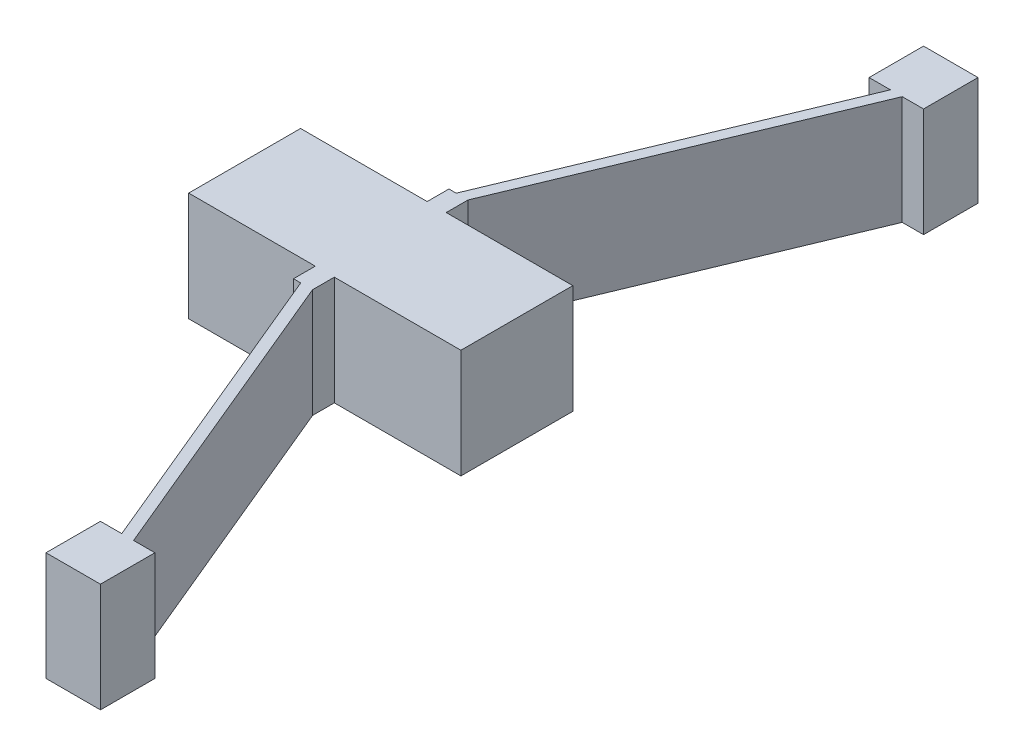
ISO-10303-21;
HEADER;
FILE_DESCRIPTION(('STEP AP214'),'2;1');
FILE_NAME('part.step','',(''),(''),'','','');
FILE_SCHEMA(('AUTOMOTIVE_DESIGN { 1 0 10303 214 1 1 1 1 }'));
ENDSEC;
DATA;
#1=APPLICATION_CONTEXT('core data for automotive mechanical design processes');
#2=APPLICATION_PROTOCOL_DEFINITION('international standard','automotive_design',2000,#1);
#3=PRODUCT_CONTEXT('',#1,'mechanical');
#4=PRODUCT('Part','Part','',(#3));
#5=PRODUCT_RELATED_PRODUCT_CATEGORY('part','',(#4));
#6=PRODUCT_DEFINITION_FORMATION('','',#4);
#7=PRODUCT_DEFINITION_CONTEXT('part definition',#1,'design');
#8=PRODUCT_DEFINITION('design','',#6,#7);
#9=PRODUCT_DEFINITION_SHAPE('','',#8);
#10=(LENGTH_UNIT() NAMED_UNIT(*) SI_UNIT(.MILLI.,.METRE.));
#11=(NAMED_UNIT(*) PLANE_ANGLE_UNIT() SI_UNIT($,.RADIAN.));
#12=(NAMED_UNIT(*) SI_UNIT($,.STERADIAN.) SOLID_ANGLE_UNIT());
#13=UNCERTAINTY_MEASURE_WITH_UNIT(LENGTH_MEASURE(1.E-05),#10,'distance_accuracy_value','');
#14=(GEOMETRIC_REPRESENTATION_CONTEXT(3) GLOBAL_UNCERTAINTY_ASSIGNED_CONTEXT((#13)) GLOBAL_UNIT_ASSIGNED_CONTEXT((#10,
#11,#12)) REPRESENTATION_CONTEXT('',''));
#15=CARTESIAN_POINT('',(0.,0.,0.));
#16=DIRECTION('',(0.,0.,1.));
#17=DIRECTION('',(1.,0.,0.));
#18=AXIS2_PLACEMENT_3D('',#15,#16,#17);
#19=CARTESIAN_POINT('',(0.,0.04,-0.02055));
#20=DIRECTION('',(0.,0.,-1.));
#21=DIRECTION('',(-1.,0.,0.));
#22=AXIS2_PLACEMENT_3D('',#19,#20,#21);
#23=PLANE('',#22);
#24=DIRECTION('',(1.,0.,0.));
#25=VECTOR('',#24,1.);
#26=CARTESIAN_POINT('',(0.,0.,-0.02055));
#27=LINE('',#26,#25);
#28=CARTESIAN_POINT('',(0.,0.,-0.02055));
#29=VERTEX_POINT('',#28);
#30=CARTESIAN_POINT('',(0.0465,0.,-0.02055));
#31=VERTEX_POINT('',#30);
#32=EDGE_CURVE('E499',#29,#31,#27,.T.);
#33=ORIENTED_EDGE('',*,*,#32,.F.);
#34=DIRECTION('',(0.,-1.,0.));
#35=VECTOR('',#34,1.);
#36=CARTESIAN_POINT('',(0.,0.04,-0.02055));
#37=LINE('',#36,#35);
#38=CARTESIAN_POINT('',(0.,0.04,-0.02055));
#39=VERTEX_POINT('',#38);
#40=EDGE_CURVE('E476',#39,#29,#37,.T.);
#41=ORIENTED_EDGE('',*,*,#40,.F.);
#42=DIRECTION('',(1.,0.,0.));
#43=VECTOR('',#42,1.);
#44=CARTESIAN_POINT('',(0.,0.04,-0.02055));
#45=LINE('',#44,#43);
#46=CARTESIAN_POINT('',(0.0465,0.04,-0.02055));
#47=VERTEX_POINT('',#46);
#48=EDGE_CURVE('E534',#39,#47,#45,.T.);
#49=ORIENTED_EDGE('',*,*,#48,.T.);
#50=DIRECTION('',(0.,-1.,0.));
#51=VECTOR('',#50,1.);
#52=CARTESIAN_POINT('',(0.0465,0.04,-0.02055));
#53=LINE('',#52,#51);
#54=EDGE_CURVE('E472',#47,#31,#53,.T.);
#55=ORIENTED_EDGE('',*,*,#54,.T.);
#56=EDGE_LOOP('',(#33,#41,#49,#55));
#57=FACE_BOUND('',#56,.T.);
#58=ADVANCED_FACE('F177',(#57),#23,.T.);
#59=CARTESIAN_POINT('',(0.0465,0.04,0.));
#60=DIRECTION('',(-1.,0.,0.));
#61=DIRECTION('',(0.,0.,1.));
#62=AXIS2_PLACEMENT_3D('',#59,#60,#61);
#63=PLANE('',#62);
#64=DIRECTION('',(0.,0.,-1.));
#65=VECTOR('',#64,1.);
#66=CARTESIAN_POINT('',(0.0465,0.,0.));
#67=LINE('',#66,#65);
#68=CARTESIAN_POINT('',(0.0465,0.,-0.02855));
#69=VERTEX_POINT('',#68);
#70=EDGE_CURVE('E500',#31,#69,#67,.T.);
#71=ORIENTED_EDGE('',*,*,#70,.F.);
#72=ORIENTED_EDGE('',*,*,#54,.F.);
#73=DIRECTION('',(0.,0.,-1.));
#74=VECTOR('',#73,1.);
#75=CARTESIAN_POINT('',(0.0465,0.04,0.));
#76=LINE('',#75,#74);
#77=CARTESIAN_POINT('',(0.0465,0.04,-0.02855));
#78=VERTEX_POINT('',#77);
#79=EDGE_CURVE('E535',#47,#78,#76,.T.);
#80=ORIENTED_EDGE('',*,*,#79,.T.);
#81=DIRECTION('',(0.,-1.,0.));
#82=VECTOR('',#81,1.);
#83=CARTESIAN_POINT('',(0.0465,0.04,-0.02855));
#84=LINE('',#83,#82);
#85=EDGE_CURVE('E468',#78,#69,#84,.T.);
#86=ORIENTED_EDGE('',*,*,#85,.T.);
#87=EDGE_LOOP('',(#71,#72,#80,#86));
#88=FACE_BOUND('',#87,.T.);
#89=ADVANCED_FACE('F679',(#88),#63,.T.);
#90=CARTESIAN_POINT('',(0.0535,0.,-0.02055));
#91=VERTEX_POINT('',#90);
#92=CARTESIAN_POINT('',(0.1,0.,-0.02055));
#93=VERTEX_POINT('',#92);
#94=EDGE_CURVE('E520',#91,#93,#27,.T.);
#95=ORIENTED_EDGE('',*,*,#94,.F.);
#96=DIRECTION('',(0.,-1.,0.));
#97=VECTOR('',#96,1.);
#98=CARTESIAN_POINT('',(0.0535,0.04,-0.02055));
#99=LINE('',#98,#97);
#100=CARTESIAN_POINT('',(0.0535,0.04,-0.02055));
#101=VERTEX_POINT('',#100);
#102=EDGE_CURVE('E448',#101,#91,#99,.T.);
#103=ORIENTED_EDGE('',*,*,#102,.F.);
#104=CARTESIAN_POINT('',(0.1,0.04,-0.02055));
#105=VERTEX_POINT('',#104);
#106=EDGE_CURVE('E555',#101,#105,#45,.T.);
#107=ORIENTED_EDGE('',*,*,#106,.T.);
#108=DIRECTION('',(0.,-1.,0.));
#109=VECTOR('',#108,1.);
#110=CARTESIAN_POINT('',(0.1,0.04,-0.02055));
#111=LINE('',#110,#109);
#112=EDGE_CURVE('E379',#105,#93,#111,.T.);
#113=ORIENTED_EDGE('',*,*,#112,.T.);
#114=EDGE_LOOP('',(#95,#103,#107,#113));
#115=FACE_BOUND('',#114,.T.);
#116=ADVANCED_FACE('F582',(#115),#23,.T.);
#117=CARTESIAN_POINT('',(0.,0.04,-0.02855));
#118=DIRECTION('',(0.,0.,1.));
#119=DIRECTION('',(1.,0.,0.));
#120=AXIS2_PLACEMENT_3D('',#117,#118,#119);
#121=PLANE('',#120);
#122=DIRECTION('',(-1.,0.,0.));
#123=VECTOR('',#122,1.);
#124=CARTESIAN_POINT('',(0.,0.,-0.02855));
#125=LINE('',#124,#123);
#126=CARTESIAN_POINT('',(0.0491672923177685,0.,-0.02855));
#127=VERTEX_POINT('',#126);
#128=EDGE_CURVE('E504',#127,#69,#125,.T.);
#129=ORIENTED_EDGE('',*,*,#128,.T.);
#130=ORIENTED_EDGE('',*,*,#85,.F.);
#131=DIRECTION('',(-1.,0.,0.));
#132=VECTOR('',#131,1.);
#133=CARTESIAN_POINT('',(0.,0.04,-0.02855));
#134=LINE('',#133,#132);
#135=CARTESIAN_POINT('',(0.0491672923177685,0.04,-0.02855));
#136=VERTEX_POINT('',#135);
#137=EDGE_CURVE('E539',#136,#78,#134,.T.);
#138=ORIENTED_EDGE('',*,*,#137,.F.);
#139=DIRECTION('',(0.,-1.,0.));
#140=VECTOR('',#139,1.);
#141=CARTESIAN_POINT('',(0.0491672923177685,0.04,-0.02855));
#142=LINE('',#141,#140);
#143=EDGE_CURVE('E464',#136,#127,#142,.T.);
#144=ORIENTED_EDGE('',*,*,#143,.T.);
#145=EDGE_LOOP('',(#129,#130,#138,#144));
#146=FACE_BOUND('',#145,.T.);
#147=ADVANCED_FACE('F675',(#146),#121,.F.);
#148=CARTESIAN_POINT('',(0.0535,0.04,0.));
#149=DIRECTION('',(-1.,0.,0.));
#150=DIRECTION('',(0.,0.,1.));
#151=AXIS2_PLACEMENT_3D('',#148,#149,#150);
#152=PLANE('',#151);
#153=DIRECTION('',(0.,0.,-1.));
#154=VECTOR('',#153,1.);
#155=CARTESIAN_POINT('',(0.0535,0.,0.));
#156=LINE('',#155,#154);
#157=CARTESIAN_POINT('',(0.0535,0.,-0.02855));
#158=VERTEX_POINT('',#157);
#159=EDGE_CURVE('E516',#91,#158,#156,.T.);
#160=ORIENTED_EDGE('',*,*,#159,.T.);
#161=DIRECTION('',(0.,-1.,0.));
#162=VECTOR('',#161,1.);
#163=CARTESIAN_POINT('',(0.0535,0.04,-0.02855));
#164=LINE('',#163,#162);
#165=CARTESIAN_POINT('',(0.0535,0.04,-0.02855));
#166=VERTEX_POINT('',#165);
#167=EDGE_CURVE('E452',#166,#158,#164,.T.);
#168=ORIENTED_EDGE('',*,*,#167,.F.);
#169=DIRECTION('',(0.,0.,-1.));
#170=VECTOR('',#169,1.);
#171=CARTESIAN_POINT('',(0.0535,0.04,0.));
#172=LINE('',#171,#170);
#173=EDGE_CURVE('E551',#101,#166,#172,.T.);
#174=ORIENTED_EDGE('',*,*,#173,.F.);
#175=ORIENTED_EDGE('',*,*,#102,.T.);
#176=EDGE_LOOP('',(#160,#168,#174,#175));
#177=FACE_BOUND('',#176,.T.);
#178=ADVANCED_FACE('F590',(#177),#152,.F.);
#179=CARTESIAN_POINT('',(0.,0.04,0.));
#180=DIRECTION('',(1.,0.,0.));
#181=DIRECTION('',(0.,0.,-1.));
#182=AXIS2_PLACEMENT_3D('',#179,#180,#181);
#183=PLANE('',#182);
#184=DIRECTION('',(0.,0.,1.));
#185=VECTOR('',#184,1.);
#186=CARTESIAN_POINT('',(0.,0.,0.));
#187=LINE('',#186,#185);
#188=CARTESIAN_POINT('',(0.,0.,0.02055));
#189=VERTEX_POINT('',#188);
#190=EDGE_CURVE('E495',#29,#189,#187,.T.);
#191=ORIENTED_EDGE('',*,*,#190,.T.);
#192=DIRECTION('',(0.,-1.,0.));
#193=VECTOR('',#192,1.);
#194=CARTESIAN_POINT('',(0.,0.04,0.02055));
#195=LINE('',#194,#193);
#196=CARTESIAN_POINT('',(0.,0.04,0.02055));
#197=VERTEX_POINT('',#196);
#198=EDGE_CURVE('E480',#197,#189,#195,.T.);
#199=ORIENTED_EDGE('',*,*,#198,.F.);
#200=DIRECTION('',(0.,0.,1.));
#201=VECTOR('',#200,1.);
#202=CARTESIAN_POINT('',(0.,0.04,0.));
#203=LINE('',#202,#201);
#204=EDGE_CURVE('E530',#39,#197,#203,.T.);
#205=ORIENTED_EDGE('',*,*,#204,.F.);
#206=ORIENTED_EDGE('',*,*,#40,.T.);
#207=EDGE_LOOP('',(#191,#199,#205,#206));
#208=FACE_BOUND('',#207,.T.);
#209=ADVANCED_FACE('F688',(#208),#183,.F.);
#210=CARTESIAN_POINT('',(0.1,0.04,0.));
#211=DIRECTION('',(1.,0.,0.));
#212=DIRECTION('',(0.,0.,-1.));
#213=AXIS2_PLACEMENT_3D('',#210,#211,#212);
#214=PLANE('',#213);
#215=DIRECTION('',(0.,0.,1.));
#216=VECTOR('',#215,1.);
#217=CARTESIAN_POINT('',(0.1,0.,0.));
#218=LINE('',#217,#216);
#219=CARTESIAN_POINT('',(0.1,0.,0.02055));
#220=VERTEX_POINT('',#219);
#221=EDGE_CURVE('E403',#93,#220,#218,.T.);
#222=ORIENTED_EDGE('',*,*,#221,.F.);
#223=ORIENTED_EDGE('',*,*,#112,.F.);
#224=DIRECTION('',(0.,0.,1.));
#225=VECTOR('',#224,1.);
#226=CARTESIAN_POINT('',(0.1,0.04,0.));
#227=LINE('',#226,#225);
#228=CARTESIAN_POINT('',(0.1,0.04,0.02055));
#229=VERTEX_POINT('',#228);
#230=EDGE_CURVE('E493',#105,#229,#227,.T.);
#231=ORIENTED_EDGE('',*,*,#230,.T.);
#232=DIRECTION('',(0.,-1.,0.));
#233=VECTOR('',#232,1.);
#234=CARTESIAN_POINT('',(0.1,0.04,0.02055));
#235=LINE('',#234,#233);
#236=EDGE_CURVE('E484',#229,#220,#235,.T.);
#237=ORIENTED_EDGE('',*,*,#236,.T.);
#238=EDGE_LOOP('',(#222,#223,#231,#237));
#239=FACE_BOUND('',#238,.T.);
#240=ADVANCED_FACE('F566',(#239),#214,.T.);
#241=CARTESIAN_POINT('',(0.,0.,0.));
#242=DIRECTION('',(0.,1.,0.));
#243=DIRECTION('',(0.,0.,1.));
#244=AXIS2_PLACEMENT_3D('',#241,#242,#243);
#245=PLANE('',#244);
#246=ORIENTED_EDGE('',*,*,#221,.T.);
#247=DIRECTION('',(1.,0.,0.));
#248=VECTOR('',#247,1.);
#249=CARTESIAN_POINT('',(0.,0.,0.02055));
#250=LINE('',#249,#248);
#251=CARTESIAN_POINT('',(0.0535,0.,0.02055));
#252=VERTEX_POINT('',#251);
#253=EDGE_CURVE('E494',#252,#220,#250,.T.);
#254=ORIENTED_EDGE('',*,*,#253,.F.);
#255=DIRECTION('',(0.,0.,1.));
#256=VECTOR('',#255,1.);
#257=CARTESIAN_POINT('',(0.0535,0.,0.02055));
#258=LINE('',#257,#256);
#259=CARTESIAN_POINT('',(0.0535,0.,0.02855));
#260=VERTEX_POINT('',#259);
#261=EDGE_CURVE('E350',#252,#260,#258,.T.);
#262=ORIENTED_EDGE('',*,*,#261,.T.);
#263=DIRECTION('',(0.384295322659801,0.,0.923210217112982));
#264=VECTOR('',#263,1.);
#265=CARTESIAN_POINT('',(0.0535,0.,0.02855));
#266=LINE('',#265,#264);
#267=CARTESIAN_POINT('',(0.100384029364496,0.,0.141181646487784));
#268=VERTEX_POINT('',#267);
#269=EDGE_CURVE('E292',#260,#268,#266,.T.);
#270=ORIENTED_EDGE('',*,*,#269,.T.);
#271=DIRECTION('',(1.,0.,0.));
#272=VECTOR('',#271,1.);
#273=CARTESIAN_POINT('',(0.0882176755233799,0.,0.141181646487784));
#274=LINE('',#273,#272);
#275=CARTESIAN_POINT('',(0.10821767552338,0.,0.141181646487784));
#276=VERTEX_POINT('',#275);
#277=EDGE_CURVE('E309',#268,#276,#274,.T.);
#278=ORIENTED_EDGE('',*,*,#277,.T.);
#279=DIRECTION('',(0.,0.,-1.));
#280=VECTOR('',#279,1.);
#281=CARTESIAN_POINT('',(0.10821767552338,0.,0.161181646487784));
#282=LINE('',#281,#280);
#283=CARTESIAN_POINT('',(0.10821767552338,0.,0.161181646487784));
#284=VERTEX_POINT('',#283);
#285=EDGE_CURVE('E303',#284,#276,#282,.T.);
#286=ORIENTED_EDGE('',*,*,#285,.F.);
#287=DIRECTION('',(1.,0.,0.));
#288=VECTOR('',#287,1.);
#289=CARTESIAN_POINT('',(0.0882176755233799,0.,0.161181646487784));
#290=LINE('',#289,#288);
#291=CARTESIAN_POINT('',(0.0882176755233799,0.,0.161181646487784));
#292=VERTEX_POINT('',#291);
#293=EDGE_CURVE('E281',#292,#284,#290,.T.);
#294=ORIENTED_EDGE('',*,*,#293,.F.);
#295=DIRECTION('',(0.,0.,-1.));
#296=VECTOR('',#295,1.);
#297=CARTESIAN_POINT('',(0.0882176755233799,0.,0.161181646487784));
#298=LINE('',#297,#296);
#299=CARTESIAN_POINT('',(0.0882176755233799,0.,0.141181646487784));
#300=VERTEX_POINT('',#299);
#301=EDGE_CURVE('E301',#292,#300,#298,.T.);
#302=ORIENTED_EDGE('',*,*,#301,.T.);
#303=CARTESIAN_POINT('',(0.0960513216822642,0.,0.141181646487784));
#304=VERTEX_POINT('',#303);
#305=EDGE_CURVE('E312',#300,#304,#274,.T.);
#306=ORIENTED_EDGE('',*,*,#305,.T.);
#307=DIRECTION('',(-0.3842953226598,0.,-0.923210217112982));
#308=VECTOR('',#307,1.);
#309=CARTESIAN_POINT('',(0.0960513216822642,0.,0.141181646487784));
#310=LINE('',#309,#308);
#311=CARTESIAN_POINT('',(0.0491672923177685,0.,0.02855));
#312=VERTEX_POINT('',#311);
#313=EDGE_CURVE('E356',#304,#312,#310,.T.);
#314=ORIENTED_EDGE('',*,*,#313,.T.);
#315=DIRECTION('',(-1.,0.,0.));
#316=VECTOR('',#315,1.);
#317=CARTESIAN_POINT('',(0.0535,0.,0.02855));
#318=LINE('',#317,#316);
#319=CARTESIAN_POINT('',(0.0465,0.,0.02855));
#320=VERTEX_POINT('',#319);
#321=EDGE_CURVE('E385',#312,#320,#318,.T.);
#322=ORIENTED_EDGE('',*,*,#321,.T.);
#323=DIRECTION('',(0.,0.,1.));
#324=VECTOR('',#323,1.);
#325=CARTESIAN_POINT('',(0.0465,0.,0.02055));
#326=LINE('',#325,#324);
#327=CARTESIAN_POINT('',(0.0465,0.,0.02055));
#328=VERTEX_POINT('',#327);
#329=EDGE_CURVE('E380',#328,#320,#326,.T.);
#330=ORIENTED_EDGE('',*,*,#329,.F.);
#331=EDGE_CURVE('E489',#189,#328,#250,.T.);
#332=ORIENTED_EDGE('',*,*,#331,.F.);
#333=ORIENTED_EDGE('',*,*,#190,.F.);
#334=ORIENTED_EDGE('',*,*,#32,.T.);
#335=ORIENTED_EDGE('',*,*,#70,.T.);
#336=ORIENTED_EDGE('',*,*,#128,.F.);
#337=DIRECTION('',(-0.3842953226598,0.,0.923210217112982));
#338=VECTOR('',#337,1.);
#339=CARTESIAN_POINT('',(0.0317770019840156,0.,0.013227489258943));
#340=LINE('',#339,#338);
#341=CARTESIAN_POINT('',(0.0960513216822642,0.,-0.141181646487784));
#342=VERTEX_POINT('',#341);
#343=EDGE_CURVE('E508',#342,#127,#340,.T.);
#344=ORIENTED_EDGE('',*,*,#343,.F.);
#345=DIRECTION('',(1.,0.,0.));
#346=VECTOR('',#345,1.);
#347=CARTESIAN_POINT('',(0.0882176755233799,0.,-0.141181646487784));
#348=LINE('',#347,#346);
#349=CARTESIAN_POINT('',(0.0882176755233799,0.,-0.141181646487784));
#350=VERTEX_POINT('',#349);
#351=EDGE_CURVE('E427',#350,#342,#348,.T.);
#352=ORIENTED_EDGE('',*,*,#351,.F.);
#353=DIRECTION('',(0.,0.,1.));
#354=VECTOR('',#353,1.);
#355=CARTESIAN_POINT('',(0.0882176755233799,0.,-0.161181646487784));
#356=LINE('',#355,#354);
#357=CARTESIAN_POINT('',(0.0882176755233799,0.,-0.161181646487784));
#358=VERTEX_POINT('',#357);
#359=EDGE_CURVE('E415',#358,#350,#356,.T.);
#360=ORIENTED_EDGE('',*,*,#359,.F.);
#361=DIRECTION('',(1.,0.,0.));
#362=VECTOR('',#361,1.);
#363=CARTESIAN_POINT('',(0.0882176755233799,0.,-0.161181646487784));
#364=LINE('',#363,#362);
#365=CARTESIAN_POINT('',(0.10821767552338,0.,-0.161181646487784));
#366=VERTEX_POINT('',#365);
#367=EDGE_CURVE('E419',#358,#366,#364,.T.);
#368=ORIENTED_EDGE('',*,*,#367,.T.);
#369=DIRECTION('',(0.,0.,1.));
#370=VECTOR('',#369,1.);
#371=CARTESIAN_POINT('',(0.10821767552338,0.,-0.161181646487784));
#372=LINE('',#371,#370);
#373=CARTESIAN_POINT('',(0.10821767552338,0.,-0.141181646487784));
#374=VERTEX_POINT('',#373);
#375=EDGE_CURVE('E423',#366,#374,#372,.T.);
#376=ORIENTED_EDGE('',*,*,#375,.T.);
#377=CARTESIAN_POINT('',(0.100384029364496,0.,-0.141181646487784));
#378=VERTEX_POINT('',#377);
#379=EDGE_CURVE('E354',#378,#374,#348,.T.);
#380=ORIENTED_EDGE('',*,*,#379,.F.);
#381=DIRECTION('',(0.384295322659801,0.,-0.923210217112982));
#382=VECTOR('',#381,1.);
#383=CARTESIAN_POINT('',(0.0354698428524675,0.,0.0147646705495822));
#384=LINE('',#383,#382);
#385=EDGE_CURVE('E512',#158,#378,#384,.T.);
#386=ORIENTED_EDGE('',*,*,#385,.F.);
#387=ORIENTED_EDGE('',*,*,#159,.F.);
#388=ORIENTED_EDGE('',*,*,#94,.T.);
#389=EDGE_LOOP('',(#246,#254,#262,#270,#278,#286,#294,#302,#306,#314,#322,#330,#332,#333,#334,
#335,#336,#344,#352,#360,#368,#376,#380,#386,#387,#388));
#390=FACE_BOUND('',#389,.T.);
#391=ADVANCED_FACE('F299',(#390),#245,.F.);
#392=CARTESIAN_POINT('',(0.,0.04,0.));
#393=DIRECTION('',(0.,1.,0.));
#394=DIRECTION('',(0.,0.,1.));
#395=AXIS2_PLACEMENT_3D('',#392,#393,#394);
#396=PLANE('',#395);
#397=ORIENTED_EDGE('',*,*,#230,.F.);
#398=ORIENTED_EDGE('',*,*,#106,.F.);
#399=ORIENTED_EDGE('',*,*,#173,.T.);
#400=DIRECTION('',(0.384295322659801,0.,-0.923210217112982));
#401=VECTOR('',#400,1.);
#402=CARTESIAN_POINT('',(0.0354698428524675,0.04,0.0147646705495822));
#403=LINE('',#402,#401);
#404=CARTESIAN_POINT('',(0.100384029364496,0.04,-0.141181646487784));
#405=VERTEX_POINT('',#404);
#406=EDGE_CURVE('E547',#166,#405,#403,.T.);
#407=ORIENTED_EDGE('',*,*,#406,.T.);
#408=DIRECTION('',(1.,0.,0.));
#409=VECTOR('',#408,1.);
#410=CARTESIAN_POINT('',(0.0882176755233799,0.04,-0.141181646487784));
#411=LINE('',#410,#409);
#412=CARTESIAN_POINT('',(0.10821767552338,0.04,-0.141181646487784));
#413=VERTEX_POINT('',#412);
#414=EDGE_CURVE('E418',#405,#413,#411,.T.);
#415=ORIENTED_EDGE('',*,*,#414,.T.);
#416=DIRECTION('',(0.,0.,1.));
#417=VECTOR('',#416,1.);
#418=CARTESIAN_POINT('',(0.10821767552338,0.04,-0.161181646487784));
#419=LINE('',#418,#417);
#420=CARTESIAN_POINT('',(0.10821767552338,0.04,-0.161181646487784));
#421=VERTEX_POINT('',#420);
#422=EDGE_CURVE('E437',#421,#413,#419,.T.);
#423=ORIENTED_EDGE('',*,*,#422,.F.);
#424=DIRECTION('',(1.,0.,0.));
#425=VECTOR('',#424,1.);
#426=CARTESIAN_POINT('',(0.0882176755233799,0.04,-0.161181646487784));
#427=LINE('',#426,#425);
#428=CARTESIAN_POINT('',(0.0882176755233799,0.04,-0.161181646487784));
#429=VERTEX_POINT('',#428);
#430=EDGE_CURVE('E433',#429,#421,#427,.T.);
#431=ORIENTED_EDGE('',*,*,#430,.F.);
#432=DIRECTION('',(0.,0.,1.));
#433=VECTOR('',#432,1.);
#434=CARTESIAN_POINT('',(0.0882176755233799,0.04,-0.161181646487784));
#435=LINE('',#434,#433);
#436=CARTESIAN_POINT('',(0.0882176755233799,0.04,-0.141181646487784));
#437=VERTEX_POINT('',#436);
#438=EDGE_CURVE('E414',#429,#437,#435,.T.);
#439=ORIENTED_EDGE('',*,*,#438,.T.);
#440=CARTESIAN_POINT('',(0.0960513216822642,0.04,-0.141181646487784));
#441=VERTEX_POINT('',#440);
#442=EDGE_CURVE('E441',#437,#441,#411,.T.);
#443=ORIENTED_EDGE('',*,*,#442,.T.);
#444=DIRECTION('',(-0.3842953226598,0.,0.923210217112982));
#445=VECTOR('',#444,1.);
#446=CARTESIAN_POINT('',(0.0317770019840156,0.04,0.013227489258943));
#447=LINE('',#446,#445);
#448=EDGE_CURVE('E543',#441,#136,#447,.T.);
#449=ORIENTED_EDGE('',*,*,#448,.T.);
#450=ORIENTED_EDGE('',*,*,#137,.T.);
#451=ORIENTED_EDGE('',*,*,#79,.F.);
#452=ORIENTED_EDGE('',*,*,#48,.F.);
#453=ORIENTED_EDGE('',*,*,#204,.T.);
#454=DIRECTION('',(1.,0.,0.));
#455=VECTOR('',#454,1.);
#456=CARTESIAN_POINT('',(0.,0.04,0.02055));
#457=LINE('',#456,#455);
#458=CARTESIAN_POINT('',(0.0465,0.04,0.02055));
#459=VERTEX_POINT('',#458);
#460=EDGE_CURVE('E488',#197,#459,#457,.T.);
#461=ORIENTED_EDGE('',*,*,#460,.T.);
#462=DIRECTION('',(0.,0.,1.));
#463=VECTOR('',#462,1.);
#464=CARTESIAN_POINT('',(0.0465,0.04,0.02055));
#465=LINE('',#464,#463);
#466=CARTESIAN_POINT('',(0.0465,0.04,0.02855));
#467=VERTEX_POINT('',#466);
#468=EDGE_CURVE('E373',#459,#467,#465,.T.);
#469=ORIENTED_EDGE('',*,*,#468,.T.);
#470=DIRECTION('',(-1.,0.,0.));
#471=VECTOR('',#470,1.);
#472=CARTESIAN_POINT('',(0.0535,0.04,0.02855));
#473=LINE('',#472,#471);
#474=CARTESIAN_POINT('',(0.0491672923177685,0.04,0.02855));
#475=VERTEX_POINT('',#474);
#476=EDGE_CURVE('E394',#475,#467,#473,.T.);
#477=ORIENTED_EDGE('',*,*,#476,.F.);
#478=DIRECTION('',(-0.3842953226598,0.,-0.923210217112982));
#479=VECTOR('',#478,1.);
#480=CARTESIAN_POINT('',(0.0960513216822642,0.04,0.141181646487784));
#481=LINE('',#480,#479);
#482=CARTESIAN_POINT('',(0.0960513216822642,0.04,0.141181646487784));
#483=VERTEX_POINT('',#482);
#484=EDGE_CURVE('E347',#483,#475,#481,.T.);
#485=ORIENTED_EDGE('',*,*,#484,.F.);
#486=DIRECTION('',(1.,0.,0.));
#487=VECTOR('',#486,1.);
#488=CARTESIAN_POINT('',(0.0882176755233799,0.04,0.141181646487784));
#489=LINE('',#488,#487);
#490=CARTESIAN_POINT('',(0.0882176755233799,0.04,0.141181646487784));
#491=VERTEX_POINT('',#490);
#492=EDGE_CURVE('E333',#491,#483,#489,.T.);
#493=ORIENTED_EDGE('',*,*,#492,.F.);
#494=DIRECTION('',(0.,0.,-1.));
#495=VECTOR('',#494,1.);
#496=CARTESIAN_POINT('',(0.0882176755233799,0.04,0.161181646487784));
#497=LINE('',#496,#495);
#498=CARTESIAN_POINT('',(0.0882176755233799,0.04,0.161181646487784));
#499=VERTEX_POINT('',#498);
#500=EDGE_CURVE('E305',#499,#491,#497,.T.);
#501=ORIENTED_EDGE('',*,*,#500,.F.);
#502=DIRECTION('',(1.,0.,0.));
#503=VECTOR('',#502,1.);
#504=CARTESIAN_POINT('',(0.0882176755233799,0.04,0.161181646487784));
#505=LINE('',#504,#503);
#506=CARTESIAN_POINT('',(0.10821767552338,0.04,0.161181646487784));
#507=VERTEX_POINT('',#506);
#508=EDGE_CURVE('E286',#499,#507,#505,.T.);
#509=ORIENTED_EDGE('',*,*,#508,.T.);
#510=DIRECTION('',(0.,0.,-1.));
#511=VECTOR('',#510,1.);
#512=CARTESIAN_POINT('',(0.10821767552338,0.04,0.161181646487784));
#513=LINE('',#512,#511);
#514=CARTESIAN_POINT('',(0.10821767552338,0.04,0.141181646487784));
#515=VERTEX_POINT('',#514);
#516=EDGE_CURVE('E329',#507,#515,#513,.T.);
#517=ORIENTED_EDGE('',*,*,#516,.T.);
#518=CARTESIAN_POINT('',(0.100384029364496,0.04,0.141181646487784));
#519=VERTEX_POINT('',#518);
#520=EDGE_CURVE('E338',#519,#515,#489,.T.);
#521=ORIENTED_EDGE('',*,*,#520,.F.);
#522=DIRECTION('',(0.384295322659801,0.,0.923210217112982));
#523=VECTOR('',#522,1.);
#524=CARTESIAN_POINT('',(0.0535,0.04,0.02855));
#525=LINE('',#524,#523);
#526=CARTESIAN_POINT('',(0.0535,0.04,0.02855));
#527=VERTEX_POINT('',#526);
#528=EDGE_CURVE('E360',#527,#519,#525,.T.);
#529=ORIENTED_EDGE('',*,*,#528,.F.);
#530=DIRECTION('',(0.,0.,1.));
#531=VECTOR('',#530,1.);
#532=CARTESIAN_POINT('',(0.0535,0.04,0.02055));
#533=LINE('',#532,#531);
#534=CARTESIAN_POINT('',(0.0535,0.04,0.02055));
#535=VERTEX_POINT('',#534);
#536=EDGE_CURVE('E384',#535,#527,#533,.T.);
#537=ORIENTED_EDGE('',*,*,#536,.F.);
#538=EDGE_CURVE('E529',#535,#229,#457,.T.);
#539=ORIENTED_EDGE('',*,*,#538,.T.);
#540=EDGE_LOOP('',(#397,#398,#399,#407,#415,#423,#431,#439,#443,#449,#450,#451,#452,#453,#461,
#469,#477,#485,#493,#501,#509,#517,#521,#529,#537,#539));
#541=FACE_BOUND('',#540,.T.);
#542=ADVANCED_FACE('F575',(#541),#396,.T.);
#543=CARTESIAN_POINT('',(0.,0.04,0.02055));
#544=DIRECTION('',(0.,0.,-1.));
#545=DIRECTION('',(-1.,0.,0.));
#546=AXIS2_PLACEMENT_3D('',#543,#544,#545);
#547=PLANE('',#546);
#548=ORIENTED_EDGE('',*,*,#538,.F.);
#549=DIRECTION('',(0.,-1.,0.));
#550=VECTOR('',#549,1.);
#551=CARTESIAN_POINT('',(0.0535,0.04,0.02055));
#552=LINE('',#551,#550);
#553=EDGE_CURVE('E188',#535,#252,#552,.T.);
#554=ORIENTED_EDGE('',*,*,#553,.T.);
#555=ORIENTED_EDGE('',*,*,#253,.T.);
#556=ORIENTED_EDGE('',*,*,#236,.F.);
#557=EDGE_LOOP('',(#548,#554,#555,#556));
#558=FACE_BOUND('',#557,.T.);
#559=ADVANCED_FACE('F632',(#558),#547,.F.);
#560=DIRECTION('',(0.,-1.,0.));
#561=VECTOR('',#560,1.);
#562=CARTESIAN_POINT('',(0.0465,0.04,0.02055));
#563=LINE('',#562,#561);
#564=EDGE_CURVE('E12',#459,#328,#563,.T.);
#565=ORIENTED_EDGE('',*,*,#564,.F.);
#566=ORIENTED_EDGE('',*,*,#460,.F.);
#567=ORIENTED_EDGE('',*,*,#198,.T.);
#568=ORIENTED_EDGE('',*,*,#331,.T.);
#569=EDGE_LOOP('',(#565,#566,#567,#568));
#570=FACE_BOUND('',#569,.T.);
#571=ADVANCED_FACE('F692',(#570),#547,.F.);
#572=CARTESIAN_POINT('',(0.0354698428524675,0.04,0.0147646705495822));
#573=DIRECTION('',(-0.923210217112982,0.,-0.384295322659801));
#574=DIRECTION('',(-0.384295322659801,0.,0.923210217112982));
#575=AXIS2_PLACEMENT_3D('',#572,#573,#574);
#576=PLANE('',#575);
#577=ORIENTED_EDGE('',*,*,#385,.T.);
#578=DIRECTION('',(0.,-1.,0.));
#579=VECTOR('',#578,1.);
#580=CARTESIAN_POINT('',(0.100384029364496,0.04,-0.141181646487784));
#581=LINE('',#580,#579);
#582=EDGE_CURVE('E456',#405,#378,#581,.T.);
#583=ORIENTED_EDGE('',*,*,#582,.F.);
#584=ORIENTED_EDGE('',*,*,#406,.F.);
#585=ORIENTED_EDGE('',*,*,#167,.T.);
#586=EDGE_LOOP('',(#577,#583,#584,#585));
#587=FACE_BOUND('',#586,.T.);
#588=ADVANCED_FACE('F741',(#587),#576,.F.);
#589=CARTESIAN_POINT('',(0.0317770019840156,0.04,0.013227489258943));
#590=DIRECTION('',(0.923210217112982,0.,0.3842953226598));
#591=DIRECTION('',(0.3842953226598,0.,-0.923210217112982));
#592=AXIS2_PLACEMENT_3D('',#589,#590,#591);
#593=PLANE('',#592);
#594=ORIENTED_EDGE('',*,*,#343,.T.);
#595=ORIENTED_EDGE('',*,*,#143,.F.);
#596=ORIENTED_EDGE('',*,*,#448,.F.);
#597=DIRECTION('',(0.,-1.,0.));
#598=VECTOR('',#597,1.);
#599=CARTESIAN_POINT('',(0.0960513216822642,0.04,-0.141181646487784));
#600=LINE('',#599,#598);
#601=EDGE_CURVE('E460',#441,#342,#600,.T.);
#602=ORIENTED_EDGE('',*,*,#601,.T.);
#603=EDGE_LOOP('',(#594,#595,#596,#602));
#604=FACE_BOUND('',#603,.T.);
#605=ADVANCED_FACE('F667',(#604),#593,.F.);
#606=CARTESIAN_POINT('',(0.0882176755233799,0.04,0.161181646487784));
#607=DIRECTION('',(0.,0.,-1.));
#608=DIRECTION('',(-1.,0.,0.));
#609=AXIS2_PLACEMENT_3D('',#606,#607,#608);
#610=PLANE('',#609);
#611=ORIENTED_EDGE('',*,*,#293,.T.);
#612=DIRECTION('',(0.,-1.,0.));
#613=VECTOR('',#612,1.);
#614=CARTESIAN_POINT('',(0.10821767552338,0.04,0.161181646487784));
#615=LINE('',#614,#613);
#616=EDGE_CURVE('E293',#507,#284,#615,.T.);
#617=ORIENTED_EDGE('',*,*,#616,.F.);
#618=ORIENTED_EDGE('',*,*,#508,.F.);
#619=DIRECTION('',(0.,-1.,0.));
#620=VECTOR('',#619,1.);
#621=CARTESIAN_POINT('',(0.0882176755233799,0.04,0.161181646487784));
#622=LINE('',#621,#620);
#623=EDGE_CURVE('E284',#499,#292,#622,.T.);
#624=ORIENTED_EDGE('',*,*,#623,.T.);
#625=EDGE_LOOP('',(#611,#617,#618,#624));
#626=FACE_BOUND('',#625,.T.);
#627=ADVANCED_FACE('F285',(#626),#610,.F.);
#628=CARTESIAN_POINT('',(0.0882176755233799,0.04,0.161181646487784));
#629=DIRECTION('',(-1.,0.,0.));
#630=DIRECTION('',(0.,0.,1.));
#631=AXIS2_PLACEMENT_3D('',#628,#629,#630);
#632=PLANE('',#631);
#633=ORIENTED_EDGE('',*,*,#301,.F.);
#634=ORIENTED_EDGE('',*,*,#623,.F.);
#635=ORIENTED_EDGE('',*,*,#500,.T.);
#636=DIRECTION('',(0.,-1.,0.));
#637=VECTOR('',#636,1.);
#638=CARTESIAN_POINT('',(0.0882176755233799,0.04,0.141181646487784));
#639=LINE('',#638,#637);
#640=EDGE_CURVE('E181',#491,#300,#639,.T.);
#641=ORIENTED_EDGE('',*,*,#640,.T.);
#642=EDGE_LOOP('',(#633,#634,#635,#641));
#643=FACE_BOUND('',#642,.T.);
#644=ADVANCED_FACE('F179',(#643),#632,.T.);
#645=CARTESIAN_POINT('',(0.0882176755233799,0.04,0.141181646487784));
#646=DIRECTION('',(0.,0.,-1.));
#647=DIRECTION('',(-1.,0.,0.));
#648=AXIS2_PLACEMENT_3D('',#645,#646,#647);
#649=PLANE('',#648);
#650=ORIENTED_EDGE('',*,*,#492,.T.);
#651=DIRECTION('',(0.,-1.,0.));
#652=VECTOR('',#651,1.);
#653=CARTESIAN_POINT('',(0.0960513216822642,0.04,0.141181646487784));
#654=LINE('',#653,#652);
#655=EDGE_CURVE('E346',#483,#304,#654,.T.);
#656=ORIENTED_EDGE('',*,*,#655,.T.);
#657=ORIENTED_EDGE('',*,*,#305,.F.);
#658=ORIENTED_EDGE('',*,*,#640,.F.);
#659=EDGE_LOOP('',(#650,#656,#657,#658));
#660=FACE_BOUND('',#659,.T.);
#661=ADVANCED_FACE('F708',(#660),#649,.T.);
#662=CARTESIAN_POINT('',(0.10821767552338,0.04,0.161181646487784));
#663=DIRECTION('',(-1.,0.,0.));
#664=DIRECTION('',(0.,0.,1.));
#665=AXIS2_PLACEMENT_3D('',#662,#663,#664);
#666=PLANE('',#665);
#667=ORIENTED_EDGE('',*,*,#285,.T.);
#668=DIRECTION('',(0.,-1.,0.));
#669=VECTOR('',#668,1.);
#670=CARTESIAN_POINT('',(0.10821767552338,0.04,0.141181646487784));
#671=LINE('',#670,#669);
#672=EDGE_CURVE('E321',#515,#276,#671,.T.);
#673=ORIENTED_EDGE('',*,*,#672,.F.);
#674=ORIENTED_EDGE('',*,*,#516,.F.);
#675=ORIENTED_EDGE('',*,*,#616,.T.);
#676=EDGE_LOOP('',(#667,#673,#674,#675));
#677=FACE_BOUND('',#676,.T.);
#678=ADVANCED_FACE('F710',(#677),#666,.F.);
#679=CARTESIAN_POINT('',(0.0960513216822642,0.04,0.141181646487784));
#680=DIRECTION('',(-0.923210217112982,0.,0.3842953226598));
#681=DIRECTION('',(0.3842953226598,0.,0.923210217112982));
#682=AXIS2_PLACEMENT_3D('',#679,#680,#681);
#683=PLANE('',#682);
#684=ORIENTED_EDGE('',*,*,#313,.F.);
#685=ORIENTED_EDGE('',*,*,#655,.F.);
#686=ORIENTED_EDGE('',*,*,#484,.T.);
#687=DIRECTION('',(0.,-1.,0.));
#688=VECTOR('',#687,1.);
#689=CARTESIAN_POINT('',(0.0491672923177685,0.04,0.02855));
#690=LINE('',#689,#688);
#691=EDGE_CURVE('E351',#475,#312,#690,.T.);
#692=ORIENTED_EDGE('',*,*,#691,.T.);
#693=EDGE_LOOP('',(#684,#685,#686,#692));
#694=FACE_BOUND('',#693,.T.);
#695=ADVANCED_FACE('F706',(#694),#683,.T.);
#696=DIRECTION('',(0.,-1.,0.));
#697=VECTOR('',#696,1.);
#698=CARTESIAN_POINT('',(0.100384029364496,0.04,0.141181646487784));
#699=LINE('',#698,#697);
#700=EDGE_CURVE('E343',#519,#268,#699,.T.);
#701=ORIENTED_EDGE('',*,*,#700,.F.);
#702=ORIENTED_EDGE('',*,*,#520,.T.);
#703=ORIENTED_EDGE('',*,*,#672,.T.);
#704=ORIENTED_EDGE('',*,*,#277,.F.);
#705=EDGE_LOOP('',(#701,#702,#703,#704));
#706=FACE_BOUND('',#705,.T.);
#707=ADVANCED_FACE('F711',(#706),#649,.T.);
#708=CARTESIAN_POINT('',(0.0535,0.04,0.02855));
#709=DIRECTION('',(0.,0.,1.));
#710=DIRECTION('',(1.,0.,0.));
#711=AXIS2_PLACEMENT_3D('',#708,#709,#710);
#712=PLANE('',#711);
#713=ORIENTED_EDGE('',*,*,#691,.F.);
#714=ORIENTED_EDGE('',*,*,#476,.T.);
#715=DIRECTION('',(0.,-1.,0.));
#716=VECTOR('',#715,1.);
#717=CARTESIAN_POINT('',(0.0465,0.04,0.02855));
#718=LINE('',#717,#716);
#719=EDGE_CURVE('E355',#467,#320,#718,.T.);
#720=ORIENTED_EDGE('',*,*,#719,.T.);
#721=ORIENTED_EDGE('',*,*,#321,.F.);
#722=EDGE_LOOP('',(#713,#714,#720,#721));
#723=FACE_BOUND('',#722,.T.);
#724=ADVANCED_FACE('F702',(#723),#712,.T.);
#725=CARTESIAN_POINT('',(0.0535,0.04,0.02855));
#726=DIRECTION('',(0.923210217112982,0.,-0.384295322659801));
#727=DIRECTION('',(-0.384295322659801,0.,-0.923210217112982));
#728=AXIS2_PLACEMENT_3D('',#725,#726,#727);
#729=PLANE('',#728);
#730=ORIENTED_EDGE('',*,*,#269,.F.);
#731=DIRECTION('',(0.,-1.,0.));
#732=VECTOR('',#731,1.);
#733=CARTESIAN_POINT('',(0.0535,0.04,0.02855));
#734=LINE('',#733,#732);
#735=EDGE_CURVE('E370',#527,#260,#734,.T.);
#736=ORIENTED_EDGE('',*,*,#735,.F.);
#737=ORIENTED_EDGE('',*,*,#528,.T.);
#738=ORIENTED_EDGE('',*,*,#700,.T.);
#739=EDGE_LOOP('',(#730,#736,#737,#738));
#740=FACE_BOUND('',#739,.T.);
#741=ADVANCED_FACE('F721',(#740),#729,.T.);
#742=CARTESIAN_POINT('',(0.0535,0.04,0.02055));
#743=DIRECTION('',(1.,0.,0.));
#744=DIRECTION('',(0.,0.,-1.));
#745=AXIS2_PLACEMENT_3D('',#742,#743,#744);
#746=PLANE('',#745);
#747=ORIENTED_EDGE('',*,*,#261,.F.);
#748=ORIENTED_EDGE('',*,*,#553,.F.);
#749=ORIENTED_EDGE('',*,*,#536,.T.);
#750=ORIENTED_EDGE('',*,*,#735,.T.);
#751=EDGE_LOOP('',(#747,#748,#749,#750));
#752=FACE_BOUND('',#751,.T.);
#753=ADVANCED_FACE('F634',(#752),#746,.T.);
#754=CARTESIAN_POINT('',(0.0465,0.04,0.02055));
#755=DIRECTION('',(1.,0.,0.));
#756=DIRECTION('',(0.,0.,-1.));
#757=AXIS2_PLACEMENT_3D('',#754,#755,#756);
#758=PLANE('',#757);
#759=ORIENTED_EDGE('',*,*,#329,.T.);
#760=ORIENTED_EDGE('',*,*,#719,.F.);
#761=ORIENTED_EDGE('',*,*,#468,.F.);
#762=ORIENTED_EDGE('',*,*,#564,.T.);
#763=EDGE_LOOP('',(#759,#760,#761,#762));
#764=FACE_BOUND('',#763,.T.);
#765=ADVANCED_FACE('F697',(#764),#758,.F.);
#766=CARTESIAN_POINT('',(0.0882176755233799,0.04,-0.161181646487784));
#767=DIRECTION('',(0.,0.,-1.));
#768=DIRECTION('',(-1.,0.,0.));
#769=AXIS2_PLACEMENT_3D('',#766,#767,#768);
#770=PLANE('',#769);
#771=ORIENTED_EDGE('',*,*,#367,.F.);
#772=DIRECTION('',(0.,-1.,0.));
#773=VECTOR('',#772,1.);
#774=CARTESIAN_POINT('',(0.0882176755233799,0.04,-0.161181646487784));
#775=LINE('',#774,#773);
#776=EDGE_CURVE('E407',#429,#358,#775,.T.);
#777=ORIENTED_EDGE('',*,*,#776,.F.);
#778=ORIENTED_EDGE('',*,*,#430,.T.);
#779=DIRECTION('',(0.,-1.,0.));
#780=VECTOR('',#779,1.);
#781=CARTESIAN_POINT('',(0.10821767552338,0.04,-0.161181646487784));
#782=LINE('',#781,#780);
#783=EDGE_CURVE('E404',#421,#366,#782,.T.);
#784=ORIENTED_EDGE('',*,*,#783,.T.);
#785=EDGE_LOOP('',(#771,#777,#778,#784));
#786=FACE_BOUND('',#785,.T.);
#787=ADVANCED_FACE('F655',(#786),#770,.T.);
#788=CARTESIAN_POINT('',(0.0882176755233799,0.04,-0.161181646487784));
#789=DIRECTION('',(1.,0.,0.));
#790=DIRECTION('',(0.,0.,-1.));
#791=AXIS2_PLACEMENT_3D('',#788,#789,#790);
#792=PLANE('',#791);
#793=ORIENTED_EDGE('',*,*,#359,.T.);
#794=DIRECTION('',(0.,-1.,0.));
#795=VECTOR('',#794,1.);
#796=CARTESIAN_POINT('',(0.0882176755233799,0.04,-0.141181646487784));
#797=LINE('',#796,#795);
#798=EDGE_CURVE('E410',#437,#350,#797,.T.);
#799=ORIENTED_EDGE('',*,*,#798,.F.);
#800=ORIENTED_EDGE('',*,*,#438,.F.);
#801=ORIENTED_EDGE('',*,*,#776,.T.);
#802=EDGE_LOOP('',(#793,#799,#800,#801));
#803=FACE_BOUND('',#802,.T.);
#804=ADVANCED_FACE('F662',(#803),#792,.F.);
#805=CARTESIAN_POINT('',(0.10821767552338,0.04,-0.161181646487784));
#806=DIRECTION('',(1.,0.,0.));
#807=DIRECTION('',(0.,0.,-1.));
#808=AXIS2_PLACEMENT_3D('',#805,#806,#807);
#809=PLANE('',#808);
#810=ORIENTED_EDGE('',*,*,#375,.F.);
#811=ORIENTED_EDGE('',*,*,#783,.F.);
#812=ORIENTED_EDGE('',*,*,#422,.T.);
#813=DIRECTION('',(0.,-1.,0.));
#814=VECTOR('',#813,1.);
#815=CARTESIAN_POINT('',(0.10821767552338,0.04,-0.141181646487784));
#816=LINE('',#815,#814);
#817=EDGE_CURVE('E399',#413,#374,#816,.T.);
#818=ORIENTED_EDGE('',*,*,#817,.T.);
#819=EDGE_LOOP('',(#810,#811,#812,#818));
#820=FACE_BOUND('',#819,.T.);
#821=ADVANCED_FACE('F649',(#820),#809,.T.);
#822=CARTESIAN_POINT('',(0.0882176755233799,0.04,-0.141181646487784));
#823=DIRECTION('',(0.,0.,-1.));
#824=DIRECTION('',(-1.,0.,0.));
#825=AXIS2_PLACEMENT_3D('',#822,#823,#824);
#826=PLANE('',#825);
#827=ORIENTED_EDGE('',*,*,#414,.F.);
#828=ORIENTED_EDGE('',*,*,#582,.T.);
#829=ORIENTED_EDGE('',*,*,#379,.T.);
#830=ORIENTED_EDGE('',*,*,#817,.F.);
#831=EDGE_LOOP('',(#827,#828,#829,#830));
#832=FACE_BOUND('',#831,.T.);
#833=ADVANCED_FACE('F645',(#832),#826,.F.);
#834=ORIENTED_EDGE('',*,*,#601,.F.);
#835=ORIENTED_EDGE('',*,*,#442,.F.);
#836=ORIENTED_EDGE('',*,*,#798,.T.);
#837=ORIENTED_EDGE('',*,*,#351,.T.);
#838=EDGE_LOOP('',(#834,#835,#836,#837));
#839=FACE_BOUND('',#838,.T.);
#840=ADVANCED_FACE('F664',(#839),#826,.F.);
#841=CLOSED_SHELL('',(#58,#89,#116,#147,#178,#209,#240,#391,#542,#559,#571,#588,#605,#627,#644,
#661,#678,#695,#707,#724,#741,#753,#765,#787,#804,#821,#833,#840));
#842=MANIFOLD_SOLID_BREP('B2',#841);
#843=ADVANCED_BREP_SHAPE_REPRESENTATION('',(#18,#842),#14);
#844=SHAPE_DEFINITION_REPRESENTATION(#9,#843);
ENDSEC;
END-ISO-10303-21;
